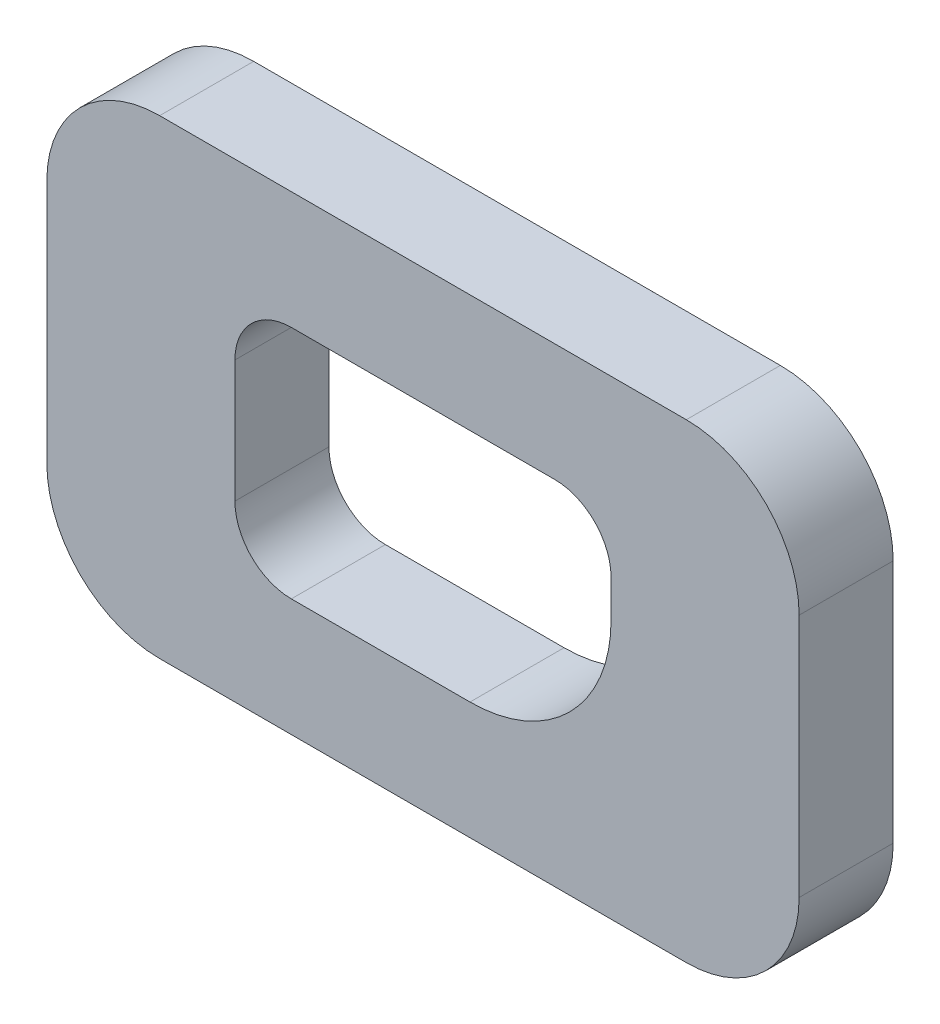
ISO-10303-21;
HEADER;
FILE_DESCRIPTION(('STEP AP214'),'2;1');
FILE_NAME('part.step','',(''),(''),'','','');
FILE_SCHEMA(('AUTOMOTIVE_DESIGN { 1 0 10303 214 1 1 1 1 }'));
ENDSEC;
DATA;
#1=APPLICATION_CONTEXT('core data for automotive mechanical design processes');
#2=APPLICATION_PROTOCOL_DEFINITION('international standard','automotive_design',2000,#1);
#3=PRODUCT_CONTEXT('',#1,'mechanical');
#4=PRODUCT('Part','Part','',(#3));
#5=PRODUCT_RELATED_PRODUCT_CATEGORY('part','',(#4));
#6=PRODUCT_DEFINITION_FORMATION('','',#4);
#7=PRODUCT_DEFINITION_CONTEXT('part definition',#1,'design');
#8=PRODUCT_DEFINITION('design','',#6,#7);
#9=PRODUCT_DEFINITION_SHAPE('','',#8);
#10=(LENGTH_UNIT() NAMED_UNIT(*) SI_UNIT(.MILLI.,.METRE.));
#11=(NAMED_UNIT(*) PLANE_ANGLE_UNIT() SI_UNIT($,.RADIAN.));
#12=(NAMED_UNIT(*) SI_UNIT($,.STERADIAN.) SOLID_ANGLE_UNIT());
#13=UNCERTAINTY_MEASURE_WITH_UNIT(LENGTH_MEASURE(1.E-05),#10,'distance_accuracy_value','');
#14=(GEOMETRIC_REPRESENTATION_CONTEXT(3) GLOBAL_UNCERTAINTY_ASSIGNED_CONTEXT((#13)) GLOBAL_UNIT_ASSIGNED_CONTEXT((#10,
#11,#12)) REPRESENTATION_CONTEXT('',''));
#15=CARTESIAN_POINT('',(0.,0.,0.));
#16=DIRECTION('',(0.,0.,1.));
#17=DIRECTION('',(1.,0.,0.));
#18=AXIS2_PLACEMENT_3D('',#15,#16,#17);
#19=CARTESIAN_POINT('',(28.,13.,10.));
#20=DIRECTION('',(0.,0.,-1.));
#21=DIRECTION('',(-1.,0.,0.));
#22=AXIS2_PLACEMENT_3D('',#19,#20,#21);
#23=PLANE('',#22);
#24=CARTESIAN_POINT('',(28.,13.,10.));
#25=DIRECTION('',(0.,0.,1.));
#26=DIRECTION('',(-1.,0.,0.));
#27=AXIS2_PLACEMENT_3D('',#24,#25,#26);
#28=CIRCLE('',#27,12.);
#29=CARTESIAN_POINT('',(40.,12.9999999999999,10.));
#30=VERTEX_POINT('',#29);
#31=CARTESIAN_POINT('',(27.9999999999999,25.,10.));
#32=VERTEX_POINT('',#31);
#33=EDGE_CURVE('E242',#30,#32,#28,.T.);
#34=ORIENTED_EDGE('',*,*,#33,.T.);
#35=DIRECTION('',(-1.,0.,0.));
#36=VECTOR('',#35,1.);
#37=CARTESIAN_POINT('',(-27.9999999999999,25.,10.));
#38=LINE('',#37,#36);
#39=CARTESIAN_POINT('',(-27.9999999999999,25.,10.));
#40=VERTEX_POINT('',#39);
#41=EDGE_CURVE('E246',#32,#40,#38,.T.);
#42=ORIENTED_EDGE('',*,*,#41,.T.);
#43=CARTESIAN_POINT('',(-28.,13.,10.));
#44=DIRECTION('',(0.,0.,1.));
#45=DIRECTION('',(-1.,0.,0.));
#46=AXIS2_PLACEMENT_3D('',#43,#44,#45);
#47=CIRCLE('',#46,12.);
#48=CARTESIAN_POINT('',(-40.,12.9999999999999,10.));
#49=VERTEX_POINT('',#48);
#50=EDGE_CURVE('E250',#40,#49,#47,.T.);
#51=ORIENTED_EDGE('',*,*,#50,.T.);
#52=DIRECTION('',(0.,-1.,0.));
#53=VECTOR('',#52,1.);
#54=CARTESIAN_POINT('',(-40.,-12.9999999999999,10.));
#55=LINE('',#54,#53);
#56=CARTESIAN_POINT('',(-40.,-12.9999999999999,10.));
#57=VERTEX_POINT('',#56);
#58=EDGE_CURVE('E253',#49,#57,#55,.T.);
#59=ORIENTED_EDGE('',*,*,#58,.T.);
#60=CARTESIAN_POINT('',(-28.,-13.,10.));
#61=DIRECTION('',(0.,0.,1.));
#62=DIRECTION('',(-1.,0.,0.));
#63=AXIS2_PLACEMENT_3D('',#60,#61,#62);
#64=CIRCLE('',#63,12.);
#65=CARTESIAN_POINT('',(-27.9999999999999,-25.,10.));
#66=VERTEX_POINT('',#65);
#67=EDGE_CURVE('E256',#57,#66,#64,.T.);
#68=ORIENTED_EDGE('',*,*,#67,.T.);
#69=DIRECTION('',(1.,0.,0.));
#70=VECTOR('',#69,1.);
#71=CARTESIAN_POINT('',(-27.9999999999999,-25.,10.));
#72=LINE('',#71,#70);
#73=CARTESIAN_POINT('',(27.9999999999999,-25.,10.));
#74=VERTEX_POINT('',#73);
#75=EDGE_CURVE('E259',#66,#74,#72,.T.);
#76=ORIENTED_EDGE('',*,*,#75,.T.);
#77=CARTESIAN_POINT('',(28.,-13.,10.));
#78=DIRECTION('',(0.,0.,1.));
#79=DIRECTION('',(1.,0.,0.));
#80=AXIS2_PLACEMENT_3D('',#77,#78,#79);
#81=CIRCLE('',#80,12.);
#82=CARTESIAN_POINT('',(40.,-13.,10.));
#83=VERTEX_POINT('',#82);
#84=EDGE_CURVE('E262',#74,#83,#81,.T.);
#85=ORIENTED_EDGE('',*,*,#84,.T.);
#86=DIRECTION('',(0.,1.,0.));
#87=VECTOR('',#86,1.);
#88=CARTESIAN_POINT('',(40.,-12.9999999999999,10.));
#89=LINE('',#88,#87);
#90=EDGE_CURVE('E265',#83,#30,#89,.T.);
#91=ORIENTED_EDGE('',*,*,#90,.T.);
#92=EDGE_LOOP('',(#34,#42,#51,#59,#68,#76,#85,#91));
#93=FACE_BOUND('',#92,.T.);
#94=CARTESIAN_POINT('',(-14.,6.5,10.));
#95=DIRECTION('',(0.,0.,1.));
#96=DIRECTION('',(-1.,0.,0.));
#97=AXIS2_PLACEMENT_3D('',#94,#95,#96);
#98=CIRCLE('',#97,6.);
#99=CARTESIAN_POINT('',(-14.,12.5,10.));
#100=VERTEX_POINT('',#99);
#101=CARTESIAN_POINT('',(-20.,6.49999999999996,10.));
#102=VERTEX_POINT('',#101);
#103=EDGE_CURVE('E153',#100,#102,#98,.T.);
#104=ORIENTED_EDGE('',*,*,#103,.F.);
#105=DIRECTION('',(-1.,0.,0.));
#106=VECTOR('',#105,1.);
#107=CARTESIAN_POINT('',(-14.,12.5,10.));
#108=LINE('',#107,#106);
#109=CARTESIAN_POINT('',(14.,12.5,10.));
#110=VERTEX_POINT('',#109);
#111=EDGE_CURVE('E194',#110,#100,#108,.T.);
#112=ORIENTED_EDGE('',*,*,#111,.F.);
#113=CARTESIAN_POINT('',(14.,6.5,10.));
#114=DIRECTION('',(0.,0.,1.));
#115=DIRECTION('',(-1.,0.,0.));
#116=AXIS2_PLACEMENT_3D('',#113,#114,#115);
#117=CIRCLE('',#116,6.);
#118=CARTESIAN_POINT('',(20.,6.49999999999996,10.));
#119=VERTEX_POINT('',#118);
#120=EDGE_CURVE('E191',#119,#110,#117,.T.);
#121=ORIENTED_EDGE('',*,*,#120,.F.);
#122=DIRECTION('',(0.,1.,0.));
#123=VECTOR('',#122,1.);
#124=CARTESIAN_POINT('',(20.,2.5,10.));
#125=LINE('',#124,#123);
#126=CARTESIAN_POINT('',(20.,2.5,10.));
#127=VERTEX_POINT('',#126);
#128=EDGE_CURVE('E188',#127,#119,#125,.T.);
#129=ORIENTED_EDGE('',*,*,#128,.F.);
#130=CARTESIAN_POINT('',(5.00000000000001,2.5,10.));
#131=DIRECTION('',(0.,0.,1.));
#132=DIRECTION('',(1.,0.,0.));
#133=AXIS2_PLACEMENT_3D('',#130,#131,#132);
#134=CIRCLE('',#133,15.);
#135=CARTESIAN_POINT('',(5.00000000000001,-12.5,10.));
#136=VERTEX_POINT('',#135);
#137=EDGE_CURVE('E185',#136,#127,#134,.T.);
#138=ORIENTED_EDGE('',*,*,#137,.F.);
#139=DIRECTION('',(1.,0.,0.));
#140=VECTOR('',#139,1.);
#141=CARTESIAN_POINT('',(-14.,-12.5,10.));
#142=LINE('',#141,#140);
#143=CARTESIAN_POINT('',(-14.,-12.5,10.));
#144=VERTEX_POINT('',#143);
#145=EDGE_CURVE('E180',#144,#136,#142,.T.);
#146=ORIENTED_EDGE('',*,*,#145,.F.);
#147=CARTESIAN_POINT('',(-14.,-6.5,10.));
#148=DIRECTION('',(0.,0.,1.));
#149=DIRECTION('',(-1.,0.,0.));
#150=AXIS2_PLACEMENT_3D('',#147,#148,#149);
#151=CIRCLE('',#150,6.);
#152=CARTESIAN_POINT('',(-20.,-6.49999999999996,10.));
#153=VERTEX_POINT('',#152);
#154=EDGE_CURVE('E176',#153,#144,#151,.T.);
#155=ORIENTED_EDGE('',*,*,#154,.F.);
#156=DIRECTION('',(0.,-1.,0.));
#157=VECTOR('',#156,1.);
#158=CARTESIAN_POINT('',(-20.,-6.49999999999996,10.));
#159=LINE('',#158,#157);
#160=EDGE_CURVE('E162',#102,#153,#159,.T.);
#161=ORIENTED_EDGE('',*,*,#160,.F.);
#162=EDGE_LOOP('',(#104,#112,#121,#129,#138,#146,#155,#161));
#163=FACE_BOUND('',#162,.T.);
#164=ADVANCED_FACE('F39',(#93,#163),#23,.F.);
#165=CARTESIAN_POINT('',(28.,13.,0.));
#166=DIRECTION('',(0.,0.,-1.));
#167=DIRECTION('',(-1.,0.,0.));
#168=AXIS2_PLACEMENT_3D('',#165,#166,#167);
#169=PLANE('',#168);
#170=CARTESIAN_POINT('',(28.,13.,0.));
#171=DIRECTION('',(0.,0.,1.));
#172=DIRECTION('',(-1.,0.,0.));
#173=AXIS2_PLACEMENT_3D('',#170,#171,#172);
#174=CIRCLE('',#173,12.);
#175=CARTESIAN_POINT('',(40.,12.9999999999999,0.));
#176=VERTEX_POINT('',#175);
#177=CARTESIAN_POINT('',(27.9999999999999,25.,0.));
#178=VERTEX_POINT('',#177);
#179=EDGE_CURVE('E171',#176,#178,#174,.T.);
#180=ORIENTED_EDGE('',*,*,#179,.F.);
#181=DIRECTION('',(0.,1.,0.));
#182=VECTOR('',#181,1.);
#183=CARTESIAN_POINT('',(40.,-12.9999999999999,0.));
#184=LINE('',#183,#182);
#185=CARTESIAN_POINT('',(40.,-13.,0.));
#186=VERTEX_POINT('',#185);
#187=EDGE_CURVE('E247',#186,#176,#184,.T.);
#188=ORIENTED_EDGE('',*,*,#187,.F.);
#189=CARTESIAN_POINT('',(28.,-13.,0.));
#190=DIRECTION('',(0.,0.,1.));
#191=DIRECTION('',(1.,0.,0.));
#192=AXIS2_PLACEMENT_3D('',#189,#190,#191);
#193=CIRCLE('',#192,12.);
#194=CARTESIAN_POINT('',(27.9999999999999,-25.,0.));
#195=VERTEX_POINT('',#194);
#196=EDGE_CURVE('E287',#195,#186,#193,.T.);
#197=ORIENTED_EDGE('',*,*,#196,.F.);
#198=DIRECTION('',(1.,0.,0.));
#199=VECTOR('',#198,1.);
#200=CARTESIAN_POINT('',(-27.9999999999999,-25.,0.));
#201=LINE('',#200,#199);
#202=CARTESIAN_POINT('',(-27.9999999999999,-25.,0.));
#203=VERTEX_POINT('',#202);
#204=EDGE_CURVE('E284',#203,#195,#201,.T.);
#205=ORIENTED_EDGE('',*,*,#204,.F.);
#206=CARTESIAN_POINT('',(-28.,-13.,0.));
#207=DIRECTION('',(0.,0.,1.));
#208=DIRECTION('',(-1.,0.,0.));
#209=AXIS2_PLACEMENT_3D('',#206,#207,#208);
#210=CIRCLE('',#209,12.);
#211=CARTESIAN_POINT('',(-40.,-12.9999999999999,0.));
#212=VERTEX_POINT('',#211);
#213=EDGE_CURVE('E281',#212,#203,#210,.T.);
#214=ORIENTED_EDGE('',*,*,#213,.F.);
#215=DIRECTION('',(0.,-1.,0.));
#216=VECTOR('',#215,1.);
#217=CARTESIAN_POINT('',(-40.,-12.9999999999999,0.));
#218=LINE('',#217,#216);
#219=CARTESIAN_POINT('',(-40.,12.9999999999999,0.));
#220=VERTEX_POINT('',#219);
#221=EDGE_CURVE('E278',#220,#212,#218,.T.);
#222=ORIENTED_EDGE('',*,*,#221,.F.);
#223=CARTESIAN_POINT('',(-28.,13.,0.));
#224=DIRECTION('',(0.,0.,1.));
#225=DIRECTION('',(-1.,0.,0.));
#226=AXIS2_PLACEMENT_3D('',#223,#224,#225);
#227=CIRCLE('',#226,12.);
#228=CARTESIAN_POINT('',(-27.9999999999999,25.,0.));
#229=VERTEX_POINT('',#228);
#230=EDGE_CURVE('E275',#229,#220,#227,.T.);
#231=ORIENTED_EDGE('',*,*,#230,.F.);
#232=DIRECTION('',(-1.,0.,0.));
#233=VECTOR('',#232,1.);
#234=CARTESIAN_POINT('',(-27.9999999999999,25.,0.));
#235=LINE('',#234,#233);
#236=EDGE_CURVE('E272',#178,#229,#235,.T.);
#237=ORIENTED_EDGE('',*,*,#236,.F.);
#238=EDGE_LOOP('',(#180,#188,#197,#205,#214,#222,#231,#237));
#239=FACE_BOUND('',#238,.T.);
#240=DIRECTION('',(-1.,0.,0.));
#241=VECTOR('',#240,1.);
#242=CARTESIAN_POINT('',(-14.,12.5,0.));
#243=LINE('',#242,#241);
#244=CARTESIAN_POINT('',(14.,12.5,0.));
#245=VERTEX_POINT('',#244);
#246=CARTESIAN_POINT('',(-14.,12.5,0.));
#247=VERTEX_POINT('',#246);
#248=EDGE_CURVE('E163',#245,#247,#243,.T.);
#249=ORIENTED_EDGE('',*,*,#248,.T.);
#250=CARTESIAN_POINT('',(-14.,6.5,0.));
#251=DIRECTION('',(0.,0.,1.));
#252=DIRECTION('',(-1.,0.,0.));
#253=AXIS2_PLACEMENT_3D('',#250,#251,#252);
#254=CIRCLE('',#253,6.);
#255=CARTESIAN_POINT('',(-20.,6.49999999999996,0.));
#256=VERTEX_POINT('',#255);
#257=EDGE_CURVE('E63',#247,#256,#254,.T.);
#258=ORIENTED_EDGE('',*,*,#257,.T.);
#259=DIRECTION('',(0.,-1.,0.));
#260=VECTOR('',#259,1.);
#261=CARTESIAN_POINT('',(-20.,-6.49999999999996,0.));
#262=LINE('',#261,#260);
#263=CARTESIAN_POINT('',(-20.,-6.49999999999996,0.));
#264=VERTEX_POINT('',#263);
#265=EDGE_CURVE('E169',#256,#264,#262,.T.);
#266=ORIENTED_EDGE('',*,*,#265,.T.);
#267=CARTESIAN_POINT('',(-14.,-6.5,0.));
#268=DIRECTION('',(0.,0.,1.));
#269=DIRECTION('',(-1.,0.,0.));
#270=AXIS2_PLACEMENT_3D('',#267,#268,#269);
#271=CIRCLE('',#270,6.);
#272=CARTESIAN_POINT('',(-14.,-12.5,0.));
#273=VERTEX_POINT('',#272);
#274=EDGE_CURVE('E201',#264,#273,#271,.T.);
#275=ORIENTED_EDGE('',*,*,#274,.T.);
#276=DIRECTION('',(1.,0.,0.));
#277=VECTOR('',#276,1.);
#278=CARTESIAN_POINT('',(-14.,-12.5,0.));
#279=LINE('',#278,#277);
#280=CARTESIAN_POINT('',(5.00000000000001,-12.5,0.));
#281=VERTEX_POINT('',#280);
#282=EDGE_CURVE('E205',#273,#281,#279,.T.);
#283=ORIENTED_EDGE('',*,*,#282,.T.);
#284=CARTESIAN_POINT('',(5.00000000000001,2.5,0.));
#285=DIRECTION('',(0.,0.,1.));
#286=DIRECTION('',(1.,0.,0.));
#287=AXIS2_PLACEMENT_3D('',#284,#285,#286);
#288=CIRCLE('',#287,15.);
#289=CARTESIAN_POINT('',(20.,2.5,0.));
#290=VERTEX_POINT('',#289);
#291=EDGE_CURVE('E209',#281,#290,#288,.T.);
#292=ORIENTED_EDGE('',*,*,#291,.T.);
#293=DIRECTION('',(0.,1.,0.));
#294=VECTOR('',#293,1.);
#295=CARTESIAN_POINT('',(20.,2.5,0.));
#296=LINE('',#295,#294);
#297=CARTESIAN_POINT('',(20.,6.49999999999996,0.));
#298=VERTEX_POINT('',#297);
#299=EDGE_CURVE('E213',#290,#298,#296,.T.);
#300=ORIENTED_EDGE('',*,*,#299,.T.);
#301=CARTESIAN_POINT('',(14.,6.5,0.));
#302=DIRECTION('',(0.,0.,1.));
#303=DIRECTION('',(-1.,0.,0.));
#304=AXIS2_PLACEMENT_3D('',#301,#302,#303);
#305=CIRCLE('',#304,6.);
#306=EDGE_CURVE('E217',#298,#245,#305,.T.);
#307=ORIENTED_EDGE('',*,*,#306,.T.);
#308=EDGE_LOOP('',(#249,#258,#266,#275,#283,#292,#300,#307));
#309=FACE_BOUND('',#308,.T.);
#310=ADVANCED_FACE('F326',(#239,#309),#169,.T.);
#311=CARTESIAN_POINT('',(28.,13.,10.));
#312=DIRECTION('',(0.,0.,-1.));
#313=DIRECTION('',(-1.,0.,0.));
#314=AXIS2_PLACEMENT_3D('',#311,#312,#313);
#315=CYLINDRICAL_SURFACE('',#314,12.);
#316=ORIENTED_EDGE('',*,*,#179,.T.);
#317=DIRECTION('',(0.,0.,-1.));
#318=VECTOR('',#317,1.);
#319=CARTESIAN_POINT('',(27.9999999999999,25.,10.));
#320=LINE('',#319,#318);
#321=EDGE_CURVE('E11',#32,#178,#320,.T.);
#322=ORIENTED_EDGE('',*,*,#321,.F.);
#323=ORIENTED_EDGE('',*,*,#33,.F.);
#324=DIRECTION('',(0.,0.,-1.));
#325=VECTOR('',#324,1.);
#326=CARTESIAN_POINT('',(40.,12.9999999999999,10.));
#327=LINE('',#326,#325);
#328=EDGE_CURVE('E268',#30,#176,#327,.T.);
#329=ORIENTED_EDGE('',*,*,#328,.T.);
#330=EDGE_LOOP('',(#316,#322,#323,#329));
#331=FACE_BOUND('',#330,.T.);
#332=ADVANCED_FACE('F41',(#331),#315,.T.);
#333=CARTESIAN_POINT('',(-27.9999999999999,25.,10.));
#334=DIRECTION('',(0.,-1.,0.));
#335=DIRECTION('',(0.,0.,-1.));
#336=AXIS2_PLACEMENT_3D('',#333,#334,#335);
#337=PLANE('',#336);
#338=ORIENTED_EDGE('',*,*,#236,.T.);
#339=DIRECTION('',(0.,0.,-1.));
#340=VECTOR('',#339,1.);
#341=CARTESIAN_POINT('',(-27.9999999999999,25.,10.));
#342=LINE('',#341,#340);
#343=EDGE_CURVE('E48',#40,#229,#342,.T.);
#344=ORIENTED_EDGE('',*,*,#343,.F.);
#345=ORIENTED_EDGE('',*,*,#41,.F.);
#346=ORIENTED_EDGE('',*,*,#321,.T.);
#347=EDGE_LOOP('',(#338,#344,#345,#346));
#348=FACE_BOUND('',#347,.T.);
#349=ADVANCED_FACE('F343',(#348),#337,.F.);
#350=CARTESIAN_POINT('',(-28.,13.,10.));
#351=DIRECTION('',(0.,0.,-1.));
#352=DIRECTION('',(-1.,0.,0.));
#353=AXIS2_PLACEMENT_3D('',#350,#351,#352);
#354=CYLINDRICAL_SURFACE('',#353,12.);
#355=ORIENTED_EDGE('',*,*,#230,.T.);
#356=DIRECTION('',(0.,0.,-1.));
#357=VECTOR('',#356,1.);
#358=CARTESIAN_POINT('',(-40.,12.9999999999999,10.));
#359=LINE('',#358,#357);
#360=EDGE_CURVE('E311',#49,#220,#359,.T.);
#361=ORIENTED_EDGE('',*,*,#360,.F.);
#362=ORIENTED_EDGE('',*,*,#50,.F.);
#363=ORIENTED_EDGE('',*,*,#343,.T.);
#364=EDGE_LOOP('',(#355,#361,#362,#363));
#365=FACE_BOUND('',#364,.T.);
#366=ADVANCED_FACE('F320',(#365),#354,.T.);
#367=CARTESIAN_POINT('',(-40.,-12.9999999999999,10.));
#368=DIRECTION('',(1.,0.,0.));
#369=DIRECTION('',(0.,0.,-1.));
#370=AXIS2_PLACEMENT_3D('',#367,#368,#369);
#371=PLANE('',#370);
#372=ORIENTED_EDGE('',*,*,#221,.T.);
#373=DIRECTION('',(0.,0.,-1.));
#374=VECTOR('',#373,1.);
#375=CARTESIAN_POINT('',(-40.,-12.9999999999999,10.));
#376=LINE('',#375,#374);
#377=EDGE_CURVE('E307',#57,#212,#376,.T.);
#378=ORIENTED_EDGE('',*,*,#377,.F.);
#379=ORIENTED_EDGE('',*,*,#58,.F.);
#380=ORIENTED_EDGE('',*,*,#360,.T.);
#381=EDGE_LOOP('',(#372,#378,#379,#380));
#382=FACE_BOUND('',#381,.T.);
#383=ADVANCED_FACE('F332',(#382),#371,.F.);
#384=CARTESIAN_POINT('',(-28.,-13.,10.));
#385=DIRECTION('',(0.,0.,-1.));
#386=DIRECTION('',(-1.,0.,0.));
#387=AXIS2_PLACEMENT_3D('',#384,#385,#386);
#388=CYLINDRICAL_SURFACE('',#387,12.);
#389=ORIENTED_EDGE('',*,*,#213,.T.);
#390=DIRECTION('',(0.,0.,-1.));
#391=VECTOR('',#390,1.);
#392=CARTESIAN_POINT('',(-27.9999999999999,-25.,10.));
#393=LINE('',#392,#391);
#394=EDGE_CURVE('E303',#66,#203,#393,.T.);
#395=ORIENTED_EDGE('',*,*,#394,.F.);
#396=ORIENTED_EDGE('',*,*,#67,.F.);
#397=ORIENTED_EDGE('',*,*,#377,.T.);
#398=EDGE_LOOP('',(#389,#395,#396,#397));
#399=FACE_BOUND('',#398,.T.);
#400=ADVANCED_FACE('F336',(#399),#388,.T.);
#401=CARTESIAN_POINT('',(-27.9999999999999,-25.,10.));
#402=DIRECTION('',(0.,1.,0.));
#403=DIRECTION('',(0.,0.,1.));
#404=AXIS2_PLACEMENT_3D('',#401,#402,#403);
#405=PLANE('',#404);
#406=ORIENTED_EDGE('',*,*,#204,.T.);
#407=DIRECTION('',(0.,0.,-1.));
#408=VECTOR('',#407,1.);
#409=CARTESIAN_POINT('',(27.9999999999999,-25.,10.));
#410=LINE('',#409,#408);
#411=EDGE_CURVE('E299',#74,#195,#410,.T.);
#412=ORIENTED_EDGE('',*,*,#411,.F.);
#413=ORIENTED_EDGE('',*,*,#75,.F.);
#414=ORIENTED_EDGE('',*,*,#394,.T.);
#415=EDGE_LOOP('',(#406,#412,#413,#414));
#416=FACE_BOUND('',#415,.T.);
#417=ADVANCED_FACE('F356',(#416),#405,.F.);
#418=CARTESIAN_POINT('',(28.,-13.,10.));
#419=DIRECTION('',(0.,0.,-1.));
#420=DIRECTION('',(-1.,0.,0.));
#421=AXIS2_PLACEMENT_3D('',#418,#419,#420);
#422=CYLINDRICAL_SURFACE('',#421,12.);
#423=ORIENTED_EDGE('',*,*,#196,.T.);
#424=DIRECTION('',(0.,0.,-1.));
#425=VECTOR('',#424,1.);
#426=CARTESIAN_POINT('',(40.,-13.,10.));
#427=LINE('',#426,#425);
#428=EDGE_CURVE('E295',#83,#186,#427,.T.);
#429=ORIENTED_EDGE('',*,*,#428,.F.);
#430=ORIENTED_EDGE('',*,*,#84,.F.);
#431=ORIENTED_EDGE('',*,*,#411,.T.);
#432=EDGE_LOOP('',(#423,#429,#430,#431));
#433=FACE_BOUND('',#432,.T.);
#434=ADVANCED_FACE('F354',(#433),#422,.T.);
#435=CARTESIAN_POINT('',(40.,-12.9999999999999,10.));
#436=DIRECTION('',(-1.,0.,0.));
#437=DIRECTION('',(0.,0.,1.));
#438=AXIS2_PLACEMENT_3D('',#435,#436,#437);
#439=PLANE('',#438);
#440=ORIENTED_EDGE('',*,*,#187,.T.);
#441=ORIENTED_EDGE('',*,*,#328,.F.);
#442=ORIENTED_EDGE('',*,*,#90,.F.);
#443=ORIENTED_EDGE('',*,*,#428,.T.);
#444=EDGE_LOOP('',(#440,#441,#442,#443));
#445=FACE_BOUND('',#444,.T.);
#446=ADVANCED_FACE('F349',(#445),#439,.F.);
#447=CARTESIAN_POINT('',(-14.,6.5,10.));
#448=DIRECTION('',(0.,0.,-1.));
#449=DIRECTION('',(-1.,0.,0.));
#450=AXIS2_PLACEMENT_3D('',#447,#448,#449);
#451=CYLINDRICAL_SURFACE('',#450,6.);
#452=ORIENTED_EDGE('',*,*,#257,.F.);
#453=DIRECTION('',(0.,0.,-1.));
#454=VECTOR('',#453,1.);
#455=CARTESIAN_POINT('',(-14.,12.5,10.));
#456=LINE('',#455,#454);
#457=EDGE_CURVE('E157',#100,#247,#456,.T.);
#458=ORIENTED_EDGE('',*,*,#457,.F.);
#459=ORIENTED_EDGE('',*,*,#103,.T.);
#460=DIRECTION('',(0.,0.,-1.));
#461=VECTOR('',#460,1.);
#462=CARTESIAN_POINT('',(-20.,6.49999999999996,10.));
#463=LINE('',#462,#461);
#464=EDGE_CURVE('E156',#102,#256,#463,.T.);
#465=ORIENTED_EDGE('',*,*,#464,.T.);
#466=EDGE_LOOP('',(#452,#458,#459,#465));
#467=FACE_BOUND('',#466,.T.);
#468=ADVANCED_FACE('F155',(#467),#451,.F.);
#469=CARTESIAN_POINT('',(-20.,-6.49999999999996,10.));
#470=DIRECTION('',(1.,0.,0.));
#471=DIRECTION('',(0.,0.,-1.));
#472=AXIS2_PLACEMENT_3D('',#469,#470,#471);
#473=PLANE('',#472);
#474=ORIENTED_EDGE('',*,*,#265,.F.);
#475=ORIENTED_EDGE('',*,*,#464,.F.);
#476=ORIENTED_EDGE('',*,*,#160,.T.);
#477=DIRECTION('',(0.,0.,-1.));
#478=VECTOR('',#477,1.);
#479=CARTESIAN_POINT('',(-20.,-6.49999999999996,10.));
#480=LINE('',#479,#478);
#481=EDGE_CURVE('E172',#153,#264,#480,.T.);
#482=ORIENTED_EDGE('',*,*,#481,.T.);
#483=EDGE_LOOP('',(#474,#475,#476,#482));
#484=FACE_BOUND('',#483,.T.);
#485=ADVANCED_FACE('F166',(#484),#473,.T.);
#486=CARTESIAN_POINT('',(-14.,-6.5,10.));
#487=DIRECTION('',(0.,0.,-1.));
#488=DIRECTION('',(-1.,0.,0.));
#489=AXIS2_PLACEMENT_3D('',#486,#487,#488);
#490=CYLINDRICAL_SURFACE('',#489,6.);
#491=ORIENTED_EDGE('',*,*,#274,.F.);
#492=ORIENTED_EDGE('',*,*,#481,.F.);
#493=ORIENTED_EDGE('',*,*,#154,.T.);
#494=DIRECTION('',(0.,0.,-1.));
#495=VECTOR('',#494,1.);
#496=CARTESIAN_POINT('',(-14.,-12.5,10.));
#497=LINE('',#496,#495);
#498=EDGE_CURVE('E237',#144,#273,#497,.T.);
#499=ORIENTED_EDGE('',*,*,#498,.T.);
#500=EDGE_LOOP('',(#491,#492,#493,#499));
#501=FACE_BOUND('',#500,.T.);
#502=ADVANCED_FACE('F381',(#501),#490,.F.);
#503=CARTESIAN_POINT('',(-14.,-12.5,10.));
#504=DIRECTION('',(0.,1.,0.));
#505=DIRECTION('',(0.,0.,1.));
#506=AXIS2_PLACEMENT_3D('',#503,#504,#505);
#507=PLANE('',#506);
#508=ORIENTED_EDGE('',*,*,#282,.F.);
#509=ORIENTED_EDGE('',*,*,#498,.F.);
#510=ORIENTED_EDGE('',*,*,#145,.T.);
#511=DIRECTION('',(0.,0.,-1.));
#512=VECTOR('',#511,1.);
#513=CARTESIAN_POINT('',(5.00000000000001,-12.5,10.));
#514=LINE('',#513,#512);
#515=EDGE_CURVE('E234',#136,#281,#514,.T.);
#516=ORIENTED_EDGE('',*,*,#515,.T.);
#517=EDGE_LOOP('',(#508,#509,#510,#516));
#518=FACE_BOUND('',#517,.T.);
#519=ADVANCED_FACE('F385',(#518),#507,.T.);
#520=CARTESIAN_POINT('',(5.00000000000001,2.5,10.));
#521=DIRECTION('',(0.,0.,-1.));
#522=DIRECTION('',(-1.,0.,0.));
#523=AXIS2_PLACEMENT_3D('',#520,#521,#522);
#524=CYLINDRICAL_SURFACE('',#523,15.);
#525=ORIENTED_EDGE('',*,*,#291,.F.);
#526=ORIENTED_EDGE('',*,*,#515,.F.);
#527=ORIENTED_EDGE('',*,*,#137,.T.);
#528=DIRECTION('',(0.,0.,-1.));
#529=VECTOR('',#528,1.);
#530=CARTESIAN_POINT('',(20.,2.5,10.));
#531=LINE('',#530,#529);
#532=EDGE_CURVE('E231',#127,#290,#531,.T.);
#533=ORIENTED_EDGE('',*,*,#532,.T.);
#534=EDGE_LOOP('',(#525,#526,#527,#533));
#535=FACE_BOUND('',#534,.T.);
#536=ADVANCED_FACE('F391',(#535),#524,.F.);
#537=CARTESIAN_POINT('',(20.,2.5,10.));
#538=DIRECTION('',(-1.,0.,0.));
#539=DIRECTION('',(0.,0.,1.));
#540=AXIS2_PLACEMENT_3D('',#537,#538,#539);
#541=PLANE('',#540);
#542=ORIENTED_EDGE('',*,*,#299,.F.);
#543=ORIENTED_EDGE('',*,*,#532,.F.);
#544=ORIENTED_EDGE('',*,*,#128,.T.);
#545=DIRECTION('',(0.,0.,-1.));
#546=VECTOR('',#545,1.);
#547=CARTESIAN_POINT('',(20.,6.49999999999996,10.));
#548=LINE('',#547,#546);
#549=EDGE_CURVE('E228',#119,#298,#548,.T.);
#550=ORIENTED_EDGE('',*,*,#549,.T.);
#551=EDGE_LOOP('',(#542,#543,#544,#550));
#552=FACE_BOUND('',#551,.T.);
#553=ADVANCED_FACE('F395',(#552),#541,.T.);
#554=CARTESIAN_POINT('',(14.,6.5,10.));
#555=DIRECTION('',(0.,0.,-1.));
#556=DIRECTION('',(-1.,0.,0.));
#557=AXIS2_PLACEMENT_3D('',#554,#555,#556);
#558=CYLINDRICAL_SURFACE('',#557,6.);
#559=ORIENTED_EDGE('',*,*,#306,.F.);
#560=ORIENTED_EDGE('',*,*,#549,.F.);
#561=ORIENTED_EDGE('',*,*,#120,.T.);
#562=DIRECTION('',(0.,0.,-1.));
#563=VECTOR('',#562,1.);
#564=CARTESIAN_POINT('',(14.,12.5,10.));
#565=LINE('',#564,#563);
#566=EDGE_CURVE('E55',#110,#245,#565,.T.);
#567=ORIENTED_EDGE('',*,*,#566,.T.);
#568=EDGE_LOOP('',(#559,#560,#561,#567));
#569=FACE_BOUND('',#568,.T.);
#570=ADVANCED_FACE('F399',(#569),#558,.F.);
#571=CARTESIAN_POINT('',(-14.,12.5,10.));
#572=DIRECTION('',(0.,-1.,0.));
#573=DIRECTION('',(0.,0.,-1.));
#574=AXIS2_PLACEMENT_3D('',#571,#572,#573);
#575=PLANE('',#574);
#576=ORIENTED_EDGE('',*,*,#248,.F.);
#577=ORIENTED_EDGE('',*,*,#566,.F.);
#578=ORIENTED_EDGE('',*,*,#111,.T.);
#579=ORIENTED_EDGE('',*,*,#457,.T.);
#580=EDGE_LOOP('',(#576,#577,#578,#579));
#581=FACE_BOUND('',#580,.T.);
#582=ADVANCED_FACE('F403',(#581),#575,.T.);
#583=CLOSED_SHELL('',(#164,#310,#332,#349,#366,#383,#400,#417,#434,#446,#468,#485,#502,#519,
#536,#553,#570,#582));
#584=MANIFOLD_SOLID_BREP('B2',#583);
#585=ADVANCED_BREP_SHAPE_REPRESENTATION('',(#18,#584),#14);
#586=SHAPE_DEFINITION_REPRESENTATION(#9,#585);
ENDSEC;
END-ISO-10303-21;
